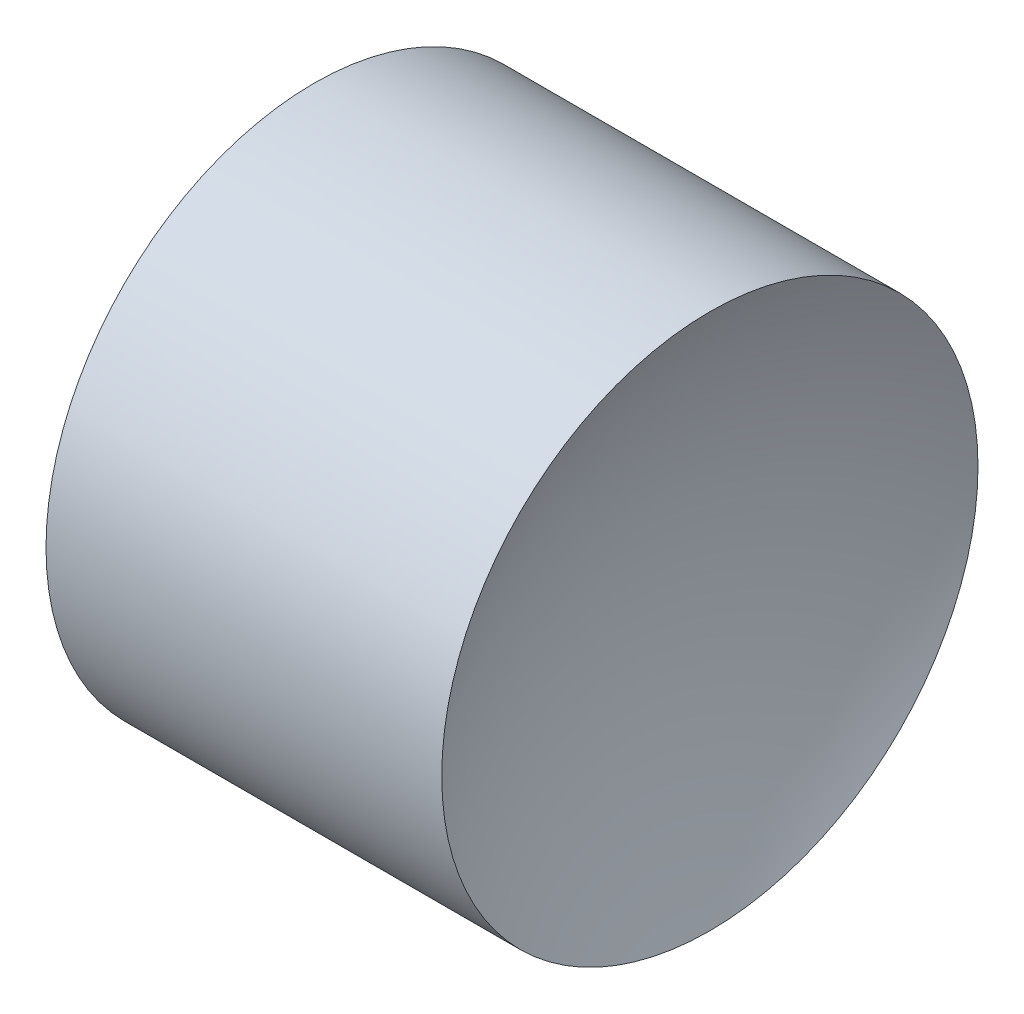
ISO-10303-21;
HEADER;
FILE_DESCRIPTION(('STEP AP214'),'2;1');
FILE_NAME('part.step','',(''),(''),'','','');
FILE_SCHEMA(('AUTOMOTIVE_DESIGN { 1 0 10303 214 1 1 1 1 }'));
ENDSEC;
DATA;
#1=APPLICATION_CONTEXT('core data for automotive mechanical design processes');
#2=APPLICATION_PROTOCOL_DEFINITION('international standard','automotive_design',2000,#1);
#3=PRODUCT_CONTEXT('',#1,'mechanical');
#4=PRODUCT('Part','Part','',(#3));
#5=PRODUCT_RELATED_PRODUCT_CATEGORY('part','',(#4));
#6=PRODUCT_DEFINITION_FORMATION('','',#4);
#7=PRODUCT_DEFINITION_CONTEXT('part definition',#1,'design');
#8=PRODUCT_DEFINITION('design','',#6,#7);
#9=PRODUCT_DEFINITION_SHAPE('','',#8);
#10=(LENGTH_UNIT() NAMED_UNIT(*) SI_UNIT(.MILLI.,.METRE.));
#11=(NAMED_UNIT(*) PLANE_ANGLE_UNIT() SI_UNIT($,.RADIAN.));
#12=(NAMED_UNIT(*) SI_UNIT($,.STERADIAN.) SOLID_ANGLE_UNIT());
#13=UNCERTAINTY_MEASURE_WITH_UNIT(LENGTH_MEASURE(1.E-05),#10,'distance_accuracy_value','');
#14=(GEOMETRIC_REPRESENTATION_CONTEXT(3) GLOBAL_UNCERTAINTY_ASSIGNED_CONTEXT((#13)) GLOBAL_UNIT_ASSIGNED_CONTEXT((#10,
#11,#12)) REPRESENTATION_CONTEXT('',''));
#15=CARTESIAN_POINT('',(0.,0.,0.));
#16=DIRECTION('',(0.,0.,1.));
#17=DIRECTION('',(1.,0.,0.));
#18=AXIS2_PLACEMENT_3D('',#15,#16,#17);
#19=CARTESIAN_POINT('',(8.70961326874907,3.26113014364937,0.));
#20=DIRECTION('',(-1.,0.,0.));
#21=DIRECTION('',(0.,-1.,0.));
#22=AXIS2_PLACEMENT_3D('',#19,#20,#21);
#23=SPHERICAL_SURFACE('',#22,2.22);
#24=CARTESIAN_POINT('',(6.72759409628882,3.26113014364937,0.));
#25=DIRECTION('',(-1.,0.,0.));
#26=DIRECTION('',(0.,0.,1.));
#27=AXIS2_PLACEMENT_3D('',#24,#25,#26);
#28=CIRCLE('',#27,1.);
#29=CARTESIAN_POINT('',(6.72759409628882,3.26113014364937,1.));
#30=VERTEX_POINT('',#29);
#31=EDGE_CURVE('E10',#30,#30,#28,.T.);
#32=ORIENTED_EDGE('',*,*,#31,.F.);
#33=EDGE_LOOP('',(#32));
#34=FACE_BOUND('',#33,.T.);
#35=ADVANCED_FACE('F35',(#34),#23,.F.);
#36=CARTESIAN_POINT('',(5.3062326392671,3.26113014364937,0.));
#37=DIRECTION('',(-1.,0.,0.));
#38=DIRECTION('',(0.,0.,1.));
#39=AXIS2_PLACEMENT_3D('',#36,#37,#38);
#40=CYLINDRICAL_SURFACE('',#39,1.);
#41=CARTESIAN_POINT('',(5.25163244120932,3.26113014364937,0.));
#42=DIRECTION('',(-1.,0.,0.));
#43=DIRECTION('',(0.,0.,1.));
#44=AXIS2_PLACEMENT_3D('',#41,#42,#43);
#45=CIRCLE('',#44,1.);
#46=CARTESIAN_POINT('',(5.25163244120932,3.26113014364937,1.));
#47=VERTEX_POINT('',#46);
#48=EDGE_CURVE('E41',#47,#47,#45,.T.);
#49=ORIENTED_EDGE('',*,*,#48,.F.);
#50=EDGE_LOOP('',(#49));
#51=FACE_BOUND('',#50,.T.);
#52=ORIENTED_EDGE('',*,*,#31,.T.);
#53=EDGE_LOOP('',(#52));
#54=FACE_BOUND('',#53,.T.);
#55=ADVANCED_FACE('F49',(#51,#54),#40,.T.);
#56=CARTESIAN_POINT('',(3.26961326874907,3.26113014364937,0.));
#57=DIRECTION('',(-1.,0.,0.));
#58=DIRECTION('',(0.,1.,0.));
#59=AXIS2_PLACEMENT_3D('',#56,#57,#58);
#60=SPHERICAL_SURFACE('',#59,2.22);
#61=ORIENTED_EDGE('',*,*,#48,.T.);
#62=EDGE_LOOP('',(#61));
#63=FACE_BOUND('',#62,.T.);
#64=ADVANCED_FACE('F47',(#63),#60,.F.);
#65=CLOSED_SHELL('',(#35,#55,#64));
#66=MANIFOLD_SOLID_BREP('B2',#65);
#67=ADVANCED_BREP_SHAPE_REPRESENTATION('',(#18,#66),#14);
#68=SHAPE_DEFINITION_REPRESENTATION(#9,#67);
ENDSEC;
END-ISO-10303-21;
